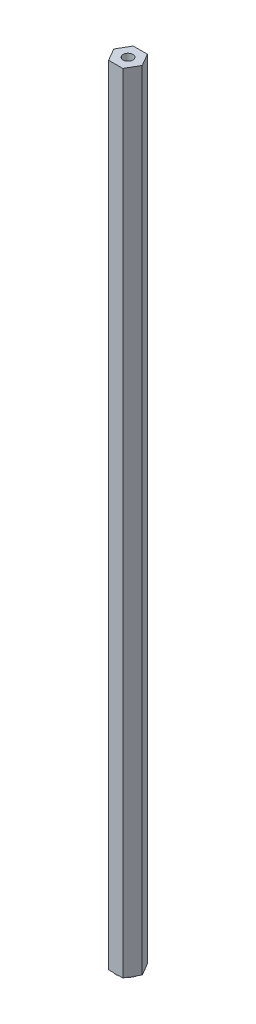
ISO-10303-21;
HEADER;
FILE_DESCRIPTION(('STEP AP214'),'2;1');
FILE_NAME('part.step','',(''),(''),'','','');
FILE_SCHEMA(('AUTOMOTIVE_DESIGN { 1 0 10303 214 1 1 1 1 }'));
ENDSEC;
DATA;
#1=APPLICATION_CONTEXT('core data for automotive mechanical design processes');
#2=APPLICATION_PROTOCOL_DEFINITION('international standard','automotive_design',2000,#1);
#3=PRODUCT_CONTEXT('',#1,'mechanical');
#4=PRODUCT('Part','Part','',(#3));
#5=PRODUCT_RELATED_PRODUCT_CATEGORY('part','',(#4));
#6=PRODUCT_DEFINITION_FORMATION('','',#4);
#7=PRODUCT_DEFINITION_CONTEXT('part definition',#1,'design');
#8=PRODUCT_DEFINITION('design','',#6,#7);
#9=PRODUCT_DEFINITION_SHAPE('','',#8);
#10=(LENGTH_UNIT() NAMED_UNIT(*) SI_UNIT(.MILLI.,.METRE.));
#11=(NAMED_UNIT(*) PLANE_ANGLE_UNIT() SI_UNIT($,.RADIAN.));
#12=(NAMED_UNIT(*) SI_UNIT($,.STERADIAN.) SOLID_ANGLE_UNIT());
#13=UNCERTAINTY_MEASURE_WITH_UNIT(LENGTH_MEASURE(1.E-05),#10,'distance_accuracy_value','');
#14=(GEOMETRIC_REPRESENTATION_CONTEXT(3) GLOBAL_UNCERTAINTY_ASSIGNED_CONTEXT((#13)) GLOBAL_UNIT_ASSIGNED_CONTEXT((#10,
#11,#12)) REPRESENTATION_CONTEXT('',''));
#15=CARTESIAN_POINT('',(0.,0.,0.));
#16=DIRECTION('',(0.,0.,1.));
#17=DIRECTION('',(1.,0.,0.));
#18=AXIS2_PLACEMENT_3D('',#15,#16,#17);
#19=CARTESIAN_POINT('',(0.,0.,0.));
#20=DIRECTION('',(0.,1.,0.));
#21=DIRECTION('',(0.,0.,1.));
#22=AXIS2_PLACEMENT_3D('',#19,#20,#21);
#23=PLANE('',#22);
#24=CARTESIAN_POINT('',(0.,0.,0.));
#25=DIRECTION('',(0.,-1.,0.));
#26=DIRECTION('',(0.,0.,-1.));
#27=AXIS2_PLACEMENT_3D('',#24,#25,#26);
#28=CIRCLE('',#27,6.35000000000001);
#29=CARTESIAN_POINT('',(0.,0.,-6.35000000000001));
#30=VERTEX_POINT('',#29);
#31=CARTESIAN_POINT('',(5.49926131403119,0.,-3.175));
#32=VERTEX_POINT('',#31);
#33=EDGE_CURVE('E47',#30,#32,#28,.T.);
#34=ORIENTED_EDGE('',*,*,#33,.F.);
#35=DIRECTION('',(-1.,0.,0.));
#36=VECTOR('',#35,1.);
#37=CARTESIAN_POINT('',(3.66617420935412,0.,-6.35000000000002));
#38=LINE('',#37,#36);
#39=CARTESIAN_POINT('',(3.66617420935412,0.,-6.35000000000002));
#40=VERTEX_POINT('',#39);
#41=EDGE_CURVE('E112',#40,#30,#38,.T.);
#42=ORIENTED_EDGE('',*,*,#41,.F.);
#43=DIRECTION('',(-0.5,0.,-0.866025403784439));
#44=VECTOR('',#43,1.);
#45=CARTESIAN_POINT('',(7.33234841870825,0.,0.));
#46=LINE('',#45,#44);
#47=EDGE_CURVE('E129',#32,#40,#46,.T.);
#48=ORIENTED_EDGE('',*,*,#47,.F.);
#49=EDGE_LOOP('',(#34,#42,#48));
#50=FACE_BOUND('',#49,.T.);
#51=ADVANCED_FACE('F36',(#50),#23,.F.);
#52=CARTESIAN_POINT('',(5.49926131403119,0.,3.175));
#53=VERTEX_POINT('',#52);
#54=EDGE_CURVE('E11',#32,#53,#28,.T.);
#55=ORIENTED_EDGE('',*,*,#54,.F.);
#56=CARTESIAN_POINT('',(7.33234841870825,0.,0.));
#57=VERTEX_POINT('',#56);
#58=EDGE_CURVE('E127',#57,#32,#46,.T.);
#59=ORIENTED_EDGE('',*,*,#58,.F.);
#60=DIRECTION('',(0.5,0.,-0.866025403784439));
#61=VECTOR('',#60,1.);
#62=CARTESIAN_POINT('',(3.66617420935412,0.,6.35000000000001));
#63=LINE('',#62,#61);
#64=EDGE_CURVE('E145',#53,#57,#63,.T.);
#65=ORIENTED_EDGE('',*,*,#64,.F.);
#66=EDGE_LOOP('',(#55,#59,#65));
#67=FACE_BOUND('',#66,.T.);
#68=ADVANCED_FACE('F200',(#67),#23,.F.);
#69=CARTESIAN_POINT('',(0.,0.,6.35000000000001));
#70=VERTEX_POINT('',#69);
#71=EDGE_CURVE('E45',#53,#70,#28,.T.);
#72=ORIENTED_EDGE('',*,*,#71,.F.);
#73=CARTESIAN_POINT('',(3.66617420935412,0.,6.35000000000001));
#74=VERTEX_POINT('',#73);
#75=EDGE_CURVE('E164',#74,#53,#63,.T.);
#76=ORIENTED_EDGE('',*,*,#75,.F.);
#77=DIRECTION('',(1.,0.,0.));
#78=VECTOR('',#77,1.);
#79=CARTESIAN_POINT('',(-3.66617420935413,0.,6.35000000000001));
#80=LINE('',#79,#78);
#81=EDGE_CURVE('E173',#70,#74,#80,.T.);
#82=ORIENTED_EDGE('',*,*,#81,.F.);
#83=EDGE_LOOP('',(#72,#76,#82));
#84=FACE_BOUND('',#83,.T.);
#85=ADVANCED_FACE('F207',(#84),#23,.F.);
#86=CARTESIAN_POINT('',(-5.4992613140312,0.,3.175));
#87=VERTEX_POINT('',#86);
#88=EDGE_CURVE('E137',#70,#87,#28,.T.);
#89=ORIENTED_EDGE('',*,*,#88,.F.);
#90=CARTESIAN_POINT('',(-3.66617420935413,0.,6.35000000000001));
#91=VERTEX_POINT('',#90);
#92=EDGE_CURVE('E153',#91,#70,#80,.T.);
#93=ORIENTED_EDGE('',*,*,#92,.F.);
#94=DIRECTION('',(0.5,0.,0.866025403784439));
#95=VECTOR('',#94,1.);
#96=CARTESIAN_POINT('',(-7.33234841870826,0.,0.));
#97=LINE('',#96,#95);
#98=EDGE_CURVE('E169',#87,#91,#97,.T.);
#99=ORIENTED_EDGE('',*,*,#98,.F.);
#100=EDGE_LOOP('',(#89,#93,#99));
#101=FACE_BOUND('',#100,.T.);
#102=ADVANCED_FACE('F215',(#101),#23,.F.);
#103=CARTESIAN_POINT('',(-5.4992613140312,0.,-3.175));
#104=VERTEX_POINT('',#103);
#105=EDGE_CURVE('E136',#87,#104,#28,.T.);
#106=ORIENTED_EDGE('',*,*,#105,.F.);
#107=CARTESIAN_POINT('',(-7.33234841870826,0.,0.));
#108=VERTEX_POINT('',#107);
#109=EDGE_CURVE('E170',#108,#87,#97,.T.);
#110=ORIENTED_EDGE('',*,*,#109,.F.);
#111=DIRECTION('',(-0.5,0.,0.866025403784439));
#112=VECTOR('',#111,1.);
#113=CARTESIAN_POINT('',(-3.66617420935413,0.,-6.35000000000002));
#114=LINE('',#113,#112);
#115=EDGE_CURVE('E122',#104,#108,#114,.T.);
#116=ORIENTED_EDGE('',*,*,#115,.F.);
#117=EDGE_LOOP('',(#106,#110,#116));
#118=FACE_BOUND('',#117,.T.);
#119=ADVANCED_FACE('F221',(#118),#23,.F.);
#120=CARTESIAN_POINT('',(3.66617420935412,406.4,6.35000000000001));
#121=DIRECTION('',(-0.866025403784439,0.,-0.5));
#122=DIRECTION('',(-0.5,0.,0.866025403784439));
#123=AXIS2_PLACEMENT_3D('',#120,#121,#122);
#124=PLANE('',#123);
#125=ORIENTED_EDGE('',*,*,#75,.T.);
#126=ORIENTED_EDGE('',*,*,#64,.T.);
#127=DIRECTION('',(0.,-1.,0.));
#128=VECTOR('',#127,1.);
#129=CARTESIAN_POINT('',(7.33234841870825,406.4,0.));
#130=LINE('',#129,#128);
#131=CARTESIAN_POINT('',(7.33234841870825,406.4,0.));
#132=VERTEX_POINT('',#131);
#133=EDGE_CURVE('E40',#132,#57,#130,.T.);
#134=ORIENTED_EDGE('',*,*,#133,.F.);
#135=DIRECTION('',(0.5,0.,-0.866025403784439));
#136=VECTOR('',#135,1.);
#137=CARTESIAN_POINT('',(3.66617420935412,406.4,6.35000000000001));
#138=LINE('',#137,#136);
#139=CARTESIAN_POINT('',(3.66617420935412,406.4,6.35000000000001));
#140=VERTEX_POINT('',#139);
#141=EDGE_CURVE('E149',#140,#132,#138,.T.);
#142=ORIENTED_EDGE('',*,*,#141,.F.);
#143=DIRECTION('',(0.,-1.,0.));
#144=VECTOR('',#143,1.);
#145=CARTESIAN_POINT('',(3.66617420935412,406.4,6.35000000000001));
#146=LINE('',#145,#144);
#147=EDGE_CURVE('E163',#140,#74,#146,.T.);
#148=ORIENTED_EDGE('',*,*,#147,.T.);
#149=EDGE_LOOP('',(#125,#126,#134,#142,#148));
#150=FACE_BOUND('',#149,.T.);
#151=ADVANCED_FACE('F38',(#150),#124,.F.);
#152=CARTESIAN_POINT('',(7.33234841870825,406.4,0.));
#153=DIRECTION('',(-0.866025403784439,0.,0.5));
#154=DIRECTION('',(0.5,0.,0.866025403784439));
#155=AXIS2_PLACEMENT_3D('',#152,#153,#154);
#156=PLANE('',#155);
#157=ORIENTED_EDGE('',*,*,#58,.T.);
#158=ORIENTED_EDGE('',*,*,#47,.T.);
#159=DIRECTION('',(0.,-1.,0.));
#160=VECTOR('',#159,1.);
#161=CARTESIAN_POINT('',(3.66617420935412,406.4,-6.35000000000002));
#162=LINE('',#161,#160);
#163=CARTESIAN_POINT('',(3.66617420935412,406.4,-6.35000000000002));
#164=VERTEX_POINT('',#163);
#165=EDGE_CURVE('E119',#164,#40,#162,.T.);
#166=ORIENTED_EDGE('',*,*,#165,.F.);
#167=DIRECTION('',(-0.5,0.,-0.866025403784439));
#168=VECTOR('',#167,1.);
#169=CARTESIAN_POINT('',(7.33234841870825,406.4,0.));
#170=LINE('',#169,#168);
#171=EDGE_CURVE('E152',#132,#164,#170,.T.);
#172=ORIENTED_EDGE('',*,*,#171,.F.);
#173=ORIENTED_EDGE('',*,*,#133,.T.);
#174=EDGE_LOOP('',(#157,#158,#166,#172,#173));
#175=FACE_BOUND('',#174,.T.);
#176=ADVANCED_FACE('F199',(#175),#156,.F.);
#177=CARTESIAN_POINT('',(3.66617420935412,406.4,-6.35000000000002));
#178=DIRECTION('',(0.,0.,1.));
#179=DIRECTION('',(1.,0.,0.));
#180=AXIS2_PLACEMENT_3D('',#177,#178,#179);
#181=PLANE('',#180);
#182=ORIENTED_EDGE('',*,*,#41,.T.);
#183=CARTESIAN_POINT('',(-3.66617420935413,0.,-6.35000000000002));
#184=VERTEX_POINT('',#183);
#185=EDGE_CURVE('E115',#30,#184,#38,.T.);
#186=ORIENTED_EDGE('',*,*,#185,.T.);
#187=DIRECTION('',(0.,-1.,0.));
#188=VECTOR('',#187,1.);
#189=CARTESIAN_POINT('',(-3.66617420935413,406.4,-6.35000000000002));
#190=LINE('',#189,#188);
#191=CARTESIAN_POINT('',(-3.66617420935413,406.4,-6.35000000000002));
#192=VERTEX_POINT('',#191);
#193=EDGE_CURVE('E187',#192,#184,#190,.T.);
#194=ORIENTED_EDGE('',*,*,#193,.F.);
#195=DIRECTION('',(-1.,0.,0.));
#196=VECTOR('',#195,1.);
#197=CARTESIAN_POINT('',(3.66617420935412,406.4,-6.35000000000002));
#198=LINE('',#197,#196);
#199=EDGE_CURVE('E155',#164,#192,#198,.T.);
#200=ORIENTED_EDGE('',*,*,#199,.F.);
#201=ORIENTED_EDGE('',*,*,#165,.T.);
#202=EDGE_LOOP('',(#182,#186,#194,#200,#201));
#203=FACE_BOUND('',#202,.T.);
#204=ADVANCED_FACE('F113',(#203),#181,.F.);
#205=CARTESIAN_POINT('',(-3.66617420935413,406.4,-6.35000000000002));
#206=DIRECTION('',(0.866025403784439,0.,0.5));
#207=DIRECTION('',(0.5,0.,-0.866025403784439));
#208=AXIS2_PLACEMENT_3D('',#205,#206,#207);
#209=PLANE('',#208);
#210=EDGE_CURVE('E126',#184,#104,#114,.T.);
#211=ORIENTED_EDGE('',*,*,#210,.T.);
#212=ORIENTED_EDGE('',*,*,#115,.T.);
#213=DIRECTION('',(0.,-1.,0.));
#214=VECTOR('',#213,1.);
#215=CARTESIAN_POINT('',(-7.33234841870826,406.4,0.));
#216=LINE('',#215,#214);
#217=CARTESIAN_POINT('',(-7.33234841870826,406.4,0.));
#218=VERTEX_POINT('',#217);
#219=EDGE_CURVE('E183',#218,#108,#216,.T.);
#220=ORIENTED_EDGE('',*,*,#219,.F.);
#221=DIRECTION('',(-0.5,0.,0.866025403784439));
#222=VECTOR('',#221,1.);
#223=CARTESIAN_POINT('',(-3.66617420935413,406.4,-6.35000000000002));
#224=LINE('',#223,#222);
#225=EDGE_CURVE('E157',#192,#218,#224,.T.);
#226=ORIENTED_EDGE('',*,*,#225,.F.);
#227=ORIENTED_EDGE('',*,*,#193,.T.);
#228=EDGE_LOOP('',(#211,#212,#220,#226,#227));
#229=FACE_BOUND('',#228,.T.);
#230=ADVANCED_FACE('F192',(#229),#209,.F.);
#231=CARTESIAN_POINT('',(-7.33234841870826,406.4,0.));
#232=DIRECTION('',(0.866025403784439,0.,-0.5));
#233=DIRECTION('',(-0.5,0.,-0.866025403784439));
#234=AXIS2_PLACEMENT_3D('',#231,#232,#233);
#235=PLANE('',#234);
#236=ORIENTED_EDGE('',*,*,#109,.T.);
#237=ORIENTED_EDGE('',*,*,#98,.T.);
#238=DIRECTION('',(0.,-1.,0.));
#239=VECTOR('',#238,1.);
#240=CARTESIAN_POINT('',(-3.66617420935413,406.4,6.35000000000001));
#241=LINE('',#240,#239);
#242=CARTESIAN_POINT('',(-3.66617420935413,406.4,6.35000000000001));
#243=VERTEX_POINT('',#242);
#244=EDGE_CURVE('E179',#243,#91,#241,.T.);
#245=ORIENTED_EDGE('',*,*,#244,.F.);
#246=DIRECTION('',(0.5,0.,0.866025403784439));
#247=VECTOR('',#246,1.);
#248=CARTESIAN_POINT('',(-7.33234841870826,406.4,0.));
#249=LINE('',#248,#247);
#250=EDGE_CURVE('E159',#218,#243,#249,.T.);
#251=ORIENTED_EDGE('',*,*,#250,.F.);
#252=ORIENTED_EDGE('',*,*,#219,.T.);
#253=EDGE_LOOP('',(#236,#237,#245,#251,#252));
#254=FACE_BOUND('',#253,.T.);
#255=ADVANCED_FACE('F218',(#254),#235,.F.);
#256=CARTESIAN_POINT('',(-3.66617420935413,406.4,6.35000000000001));
#257=DIRECTION('',(0.,0.,-1.));
#258=DIRECTION('',(-1.,0.,0.));
#259=AXIS2_PLACEMENT_3D('',#256,#257,#258);
#260=PLANE('',#259);
#261=ORIENTED_EDGE('',*,*,#92,.T.);
#262=ORIENTED_EDGE('',*,*,#81,.T.);
#263=ORIENTED_EDGE('',*,*,#147,.F.);
#264=DIRECTION('',(1.,0.,0.));
#265=VECTOR('',#264,1.);
#266=CARTESIAN_POINT('',(-3.66617420935413,406.4,6.35000000000001));
#267=LINE('',#266,#265);
#268=EDGE_CURVE('E161',#243,#140,#267,.T.);
#269=ORIENTED_EDGE('',*,*,#268,.F.);
#270=ORIENTED_EDGE('',*,*,#244,.T.);
#271=EDGE_LOOP('',(#261,#262,#263,#269,#270));
#272=FACE_BOUND('',#271,.T.);
#273=ADVANCED_FACE('F210',(#272),#260,.F.);
#274=CARTESIAN_POINT('',(0.,406.4,0.));
#275=DIRECTION('',(0.,1.,0.));
#276=DIRECTION('',(0.,0.,1.));
#277=AXIS2_PLACEMENT_3D('',#274,#275,#276);
#278=PLANE('',#277);
#279=CARTESIAN_POINT('',(0.,406.4,0.));
#280=DIRECTION('',(0.,1.,0.));
#281=DIRECTION('',(0.,0.,1.));
#282=AXIS2_PLACEMENT_3D('',#279,#280,#281);
#283=CIRCLE('',#282,2.54);
#284=CARTESIAN_POINT('',(0.,406.4,2.54));
#285=VERTEX_POINT('',#284);
#286=EDGE_CURVE('E146',#285,#285,#283,.T.);
#287=ORIENTED_EDGE('',*,*,#286,.F.);
#288=EDGE_LOOP('',(#287));
#289=FACE_BOUND('',#288,.T.);
#290=ORIENTED_EDGE('',*,*,#141,.T.);
#291=ORIENTED_EDGE('',*,*,#171,.T.);
#292=ORIENTED_EDGE('',*,*,#199,.T.);
#293=ORIENTED_EDGE('',*,*,#225,.T.);
#294=ORIENTED_EDGE('',*,*,#250,.T.);
#295=ORIENTED_EDGE('',*,*,#268,.T.);
#296=EDGE_LOOP('',(#290,#291,#292,#293,#294,#295));
#297=FACE_BOUND('',#296,.T.);
#298=ADVANCED_FACE('F195',(#289,#297),#278,.T.);
#299=EDGE_CURVE('E60',#104,#30,#28,.T.);
#300=ORIENTED_EDGE('',*,*,#299,.F.);
#301=ORIENTED_EDGE('',*,*,#210,.F.);
#302=ORIENTED_EDGE('',*,*,#185,.F.);
#303=EDGE_LOOP('',(#300,#301,#302));
#304=FACE_BOUND('',#303,.T.);
#305=ADVANCED_FACE('F124',(#304),#23,.F.);
#306=CARTESIAN_POINT('',(0.,381.,0.));
#307=DIRECTION('',(0.,1.,0.));
#308=DIRECTION('',(0.,0.,1.));
#309=AXIS2_PLACEMENT_3D('',#306,#307,#308);
#310=CYLINDRICAL_SURFACE('',#309,2.54);
#311=CARTESIAN_POINT('',(0.,381.,0.));
#312=DIRECTION('',(0.,1.,0.));
#313=DIRECTION('',(0.,0.,1.));
#314=AXIS2_PLACEMENT_3D('',#311,#312,#313);
#315=CIRCLE('',#314,2.54);
#316=CARTESIAN_POINT('',(0.,381.,2.54));
#317=VERTEX_POINT('',#316);
#318=EDGE_CURVE('E142',#317,#317,#315,.T.);
#319=ORIENTED_EDGE('',*,*,#318,.F.);
#320=EDGE_LOOP('',(#319));
#321=FACE_BOUND('',#320,.T.);
#322=ORIENTED_EDGE('',*,*,#286,.T.);
#323=EDGE_LOOP('',(#322));
#324=FACE_BOUND('',#323,.T.);
#325=ADVANCED_FACE('F231',(#321,#324),#310,.F.);
#326=CARTESIAN_POINT('',(0.,381.,0.));
#327=DIRECTION('',(0.,1.,0.));
#328=DIRECTION('',(0.,0.,1.));
#329=AXIS2_PLACEMENT_3D('',#326,#327,#328);
#330=PLANE('',#329);
#331=ORIENTED_EDGE('',*,*,#318,.T.);
#332=EDGE_LOOP('',(#331));
#333=FACE_BOUND('',#332,.T.);
#334=ADVANCED_FACE('F314',(#333),#330,.T.);
#335=CARTESIAN_POINT('',(0.,-0.254,0.));
#336=DIRECTION('',(0.,1.,0.));
#337=DIRECTION('',(0.,0.,1.));
#338=AXIS2_PLACEMENT_3D('',#335,#336,#337);
#339=CYLINDRICAL_SURFACE('',#338,6.35000000000001);
#340=CARTESIAN_POINT('',(0.,-0.254,0.));
#341=DIRECTION('',(0.,-1.,0.));
#342=DIRECTION('',(0.,0.,-1.));
#343=AXIS2_PLACEMENT_3D('',#340,#341,#342);
#344=CIRCLE('',#343,6.35000000000001);
#345=CARTESIAN_POINT('',(0.,-0.254,-6.35000000000001));
#346=VERTEX_POINT('',#345);
#347=EDGE_CURVE('E132',#346,#346,#344,.T.);
#348=ORIENTED_EDGE('',*,*,#347,.F.);
#349=EDGE_LOOP('',(#348));
#350=FACE_BOUND('',#349,.T.);
#351=ORIENTED_EDGE('',*,*,#33,.T.);
#352=ORIENTED_EDGE('',*,*,#54,.T.);
#353=ORIENTED_EDGE('',*,*,#71,.T.);
#354=ORIENTED_EDGE('',*,*,#88,.T.);
#355=ORIENTED_EDGE('',*,*,#105,.T.);
#356=ORIENTED_EDGE('',*,*,#299,.T.);
#357=EDGE_LOOP('',(#351,#352,#353,#354,#355,#356));
#358=FACE_BOUND('',#357,.T.);
#359=ADVANCED_FACE('F134',(#350,#358),#339,.T.);
#360=CARTESIAN_POINT('',(0.,-0.254,0.));
#361=DIRECTION('',(0.,-1.,0.));
#362=DIRECTION('',(0.,0.,-1.));
#363=AXIS2_PLACEMENT_3D('',#360,#361,#362);
#364=PLANE('',#363);
#365=ORIENTED_EDGE('',*,*,#347,.T.);
#366=EDGE_LOOP('',(#365));
#367=FACE_BOUND('',#366,.T.);
#368=ADVANCED_FACE('F313',(#367),#364,.T.);
#369=CLOSED_SHELL('',(#51,#68,#85,#102,#119,#151,#176,#204,#230,#255,#273,#298,#305,#325,#334,
#359,#368));
#370=MANIFOLD_SOLID_BREP('B2',#369);
#371=ADVANCED_BREP_SHAPE_REPRESENTATION('',(#18,#370),#14);
#372=SHAPE_DEFINITION_REPRESENTATION(#9,#371);
ENDSEC;
END-ISO-10303-21;
